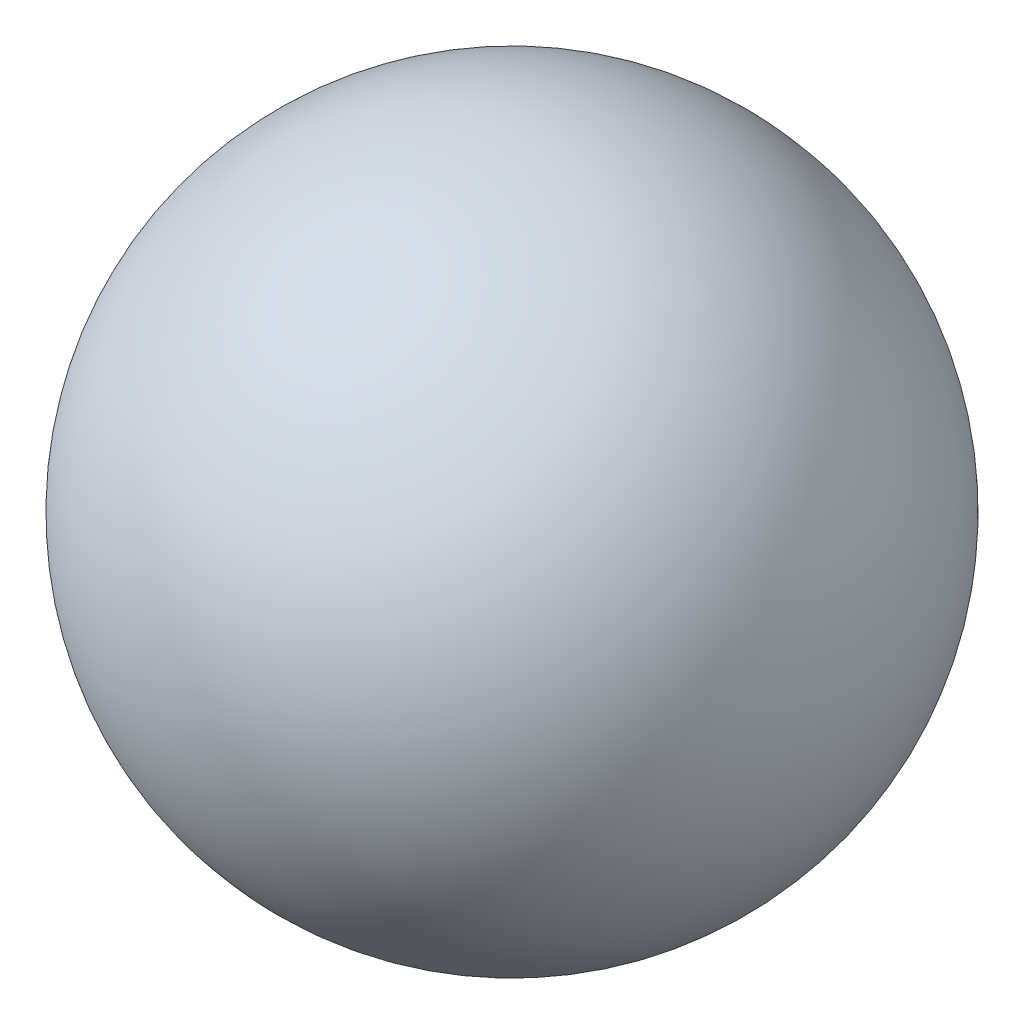
ISO-10303-21;
HEADER;
FILE_DESCRIPTION(('STEP AP214'),'2;1');
FILE_NAME('part.step','',(''),(''),'','','');
FILE_SCHEMA(('AUTOMOTIVE_DESIGN { 1 0 10303 214 1 1 1 1 }'));
ENDSEC;
DATA;
#1=APPLICATION_CONTEXT('core data for automotive mechanical design processes');
#2=APPLICATION_PROTOCOL_DEFINITION('international standard','automotive_design',2000,#1);
#3=PRODUCT_CONTEXT('',#1,'mechanical');
#4=PRODUCT('Part','Part','',(#3));
#5=PRODUCT_RELATED_PRODUCT_CATEGORY('part','',(#4));
#6=PRODUCT_DEFINITION_FORMATION('','',#4);
#7=PRODUCT_DEFINITION_CONTEXT('part definition',#1,'design');
#8=PRODUCT_DEFINITION('design','',#6,#7);
#9=PRODUCT_DEFINITION_SHAPE('','',#8);
#10=(LENGTH_UNIT() NAMED_UNIT(*) SI_UNIT(.MILLI.,.METRE.));
#11=(NAMED_UNIT(*) PLANE_ANGLE_UNIT() SI_UNIT($,.RADIAN.));
#12=(NAMED_UNIT(*) SI_UNIT($,.STERADIAN.) SOLID_ANGLE_UNIT());
#13=UNCERTAINTY_MEASURE_WITH_UNIT(LENGTH_MEASURE(1.E-05),#10,'distance_accuracy_value','');
#14=(GEOMETRIC_REPRESENTATION_CONTEXT(3) GLOBAL_UNCERTAINTY_ASSIGNED_CONTEXT((#13)) GLOBAL_UNIT_ASSIGNED_CONTEXT((#10,
#11,#12)) REPRESENTATION_CONTEXT('',''));
#15=CARTESIAN_POINT('',(0.,0.,0.));
#16=DIRECTION('',(0.,0.,1.));
#17=DIRECTION('',(1.,0.,0.));
#18=AXIS2_PLACEMENT_3D('',#15,#16,#17);
#19=CARTESIAN_POINT('',(64.16,36.5662485822867,-58.9653300984436));
#20=DIRECTION('',(0.,0.527020287134986,-0.84985270308928));
#21=DIRECTION('',(0.173648177666934,0.836941530920705,0.519013664765254));
#22=AXIS2_PLACEMENT_3D('',#19,#20,#21);
#23=SPHERICAL_SURFACE('',#22,7.15);
#24=CARTESIAN_POINT('',(64.16,40.3344436353019,-65.0417769255319));
#25=VERTEX_POINT('',#24);
#26=VERTEX_LOOP('',#25);
#27=FACE_BOUND('',#26,.T.);
#28=CARTESIAN_POINT('',(64.16,32.7980535292715,-52.8888832713552));
#29=VERTEX_POINT('',#28);
#30=VERTEX_LOOP('',#29);
#31=FACE_BOUND('',#30,.T.);
#32=ADVANCED_FACE('F15',(#27,#31),#23,.T.);
#33=CLOSED_SHELL('',(#32));
#34=MANIFOLD_SOLID_BREP('B1',#33);
#35=ADVANCED_BREP_SHAPE_REPRESENTATION('',(#18,#34),#14);
#36=SHAPE_DEFINITION_REPRESENTATION(#9,#35);
ENDSEC;
END-ISO-10303-21;
